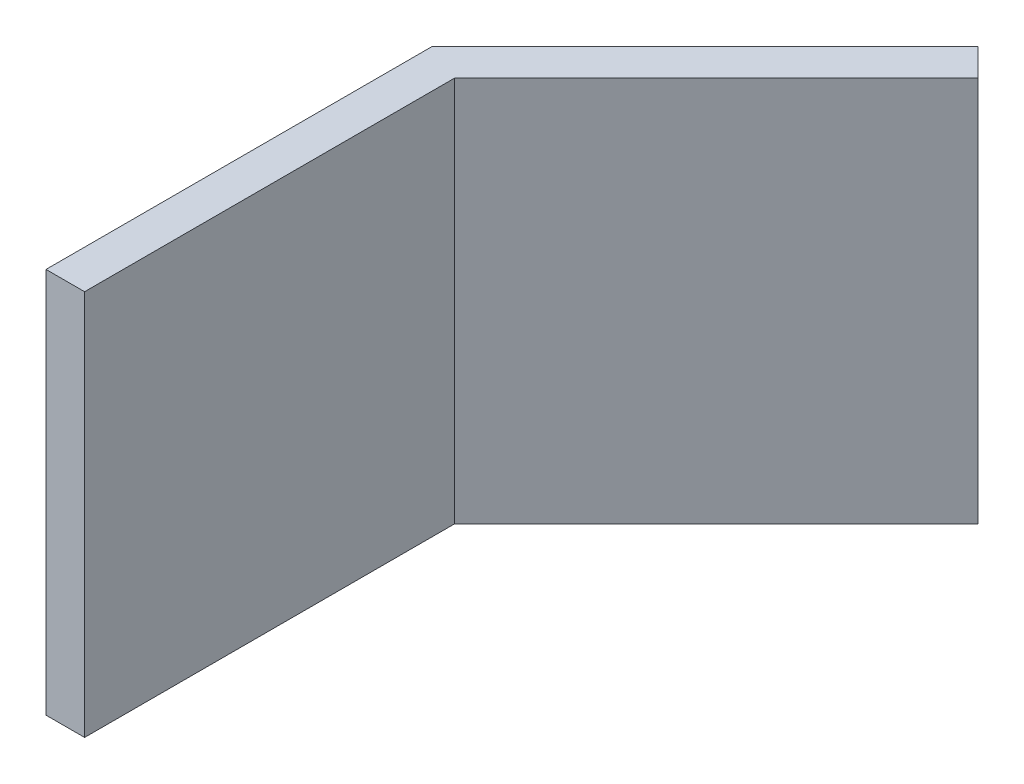
ISO-10303-21;
HEADER;
FILE_DESCRIPTION(('STEP AP214'),'2;1');
FILE_NAME('part.step','',(''),(''),'','','');
FILE_SCHEMA(('AUTOMOTIVE_DESIGN { 1 0 10303 214 1 1 1 1 }'));
ENDSEC;
DATA;
#1=APPLICATION_CONTEXT('core data for automotive mechanical design processes');
#2=APPLICATION_PROTOCOL_DEFINITION('international standard','automotive_design',2000,#1);
#3=PRODUCT_CONTEXT('',#1,'mechanical');
#4=PRODUCT('Part','Part','',(#3));
#5=PRODUCT_RELATED_PRODUCT_CATEGORY('part','',(#4));
#6=PRODUCT_DEFINITION_FORMATION('','',#4);
#7=PRODUCT_DEFINITION_CONTEXT('part definition',#1,'design');
#8=PRODUCT_DEFINITION('design','',#6,#7);
#9=PRODUCT_DEFINITION_SHAPE('','',#8);
#10=(LENGTH_UNIT() NAMED_UNIT(*) SI_UNIT(.MILLI.,.METRE.));
#11=(NAMED_UNIT(*) PLANE_ANGLE_UNIT() SI_UNIT($,.RADIAN.));
#12=(NAMED_UNIT(*) SI_UNIT($,.STERADIAN.) SOLID_ANGLE_UNIT());
#13=UNCERTAINTY_MEASURE_WITH_UNIT(LENGTH_MEASURE(1.E-05),#10,'distance_accuracy_value','');
#14=(GEOMETRIC_REPRESENTATION_CONTEXT(3) GLOBAL_UNCERTAINTY_ASSIGNED_CONTEXT((#13)) GLOBAL_UNIT_ASSIGNED_CONTEXT((#10,
#11,#12)) REPRESENTATION_CONTEXT('',''));
#15=CARTESIAN_POINT('',(0.,0.,0.));
#16=DIRECTION('',(0.,0.,1.));
#17=DIRECTION('',(1.,0.,0.));
#18=AXIS2_PLACEMENT_3D('',#15,#16,#17);
#19=CARTESIAN_POINT('',(2.,20.,0.));
#20=DIRECTION('',(0.,0.,-1.));
#21=DIRECTION('',(-1.,0.,0.));
#22=AXIS2_PLACEMENT_3D('',#19,#20,#21);
#23=PLANE('',#22);
#24=DIRECTION('',(1.,0.,0.));
#25=VECTOR('',#24,1.);
#26=CARTESIAN_POINT('',(2.,0.,0.));
#27=LINE('',#26,#25);
#28=CARTESIAN_POINT('',(0.,0.,0.));
#29=VERTEX_POINT('',#28);
#30=CARTESIAN_POINT('',(2.,0.,0.));
#31=VERTEX_POINT('',#30);
#32=EDGE_CURVE('E115',#29,#31,#27,.T.);
#33=ORIENTED_EDGE('',*,*,#32,.T.);
#34=DIRECTION('',(0.,-1.,0.));
#35=VECTOR('',#34,1.);
#36=CARTESIAN_POINT('',(2.,20.,0.));
#37=LINE('',#36,#35);
#38=CARTESIAN_POINT('',(2.,20.,0.));
#39=VERTEX_POINT('',#38);
#40=EDGE_CURVE('E11',#39,#31,#37,.T.);
#41=ORIENTED_EDGE('',*,*,#40,.F.);
#42=DIRECTION('',(1.,0.,0.));
#43=VECTOR('',#42,1.);
#44=CARTESIAN_POINT('',(2.,20.,0.));
#45=LINE('',#44,#43);
#46=CARTESIAN_POINT('',(0.,20.,0.));
#47=VERTEX_POINT('',#46);
#48=EDGE_CURVE('E125',#47,#39,#45,.T.);
#49=ORIENTED_EDGE('',*,*,#48,.F.);
#50=DIRECTION('',(0.,-1.,0.));
#51=VECTOR('',#50,1.);
#52=CARTESIAN_POINT('',(0.,20.,0.));
#53=LINE('',#52,#51);
#54=EDGE_CURVE('E111',#47,#29,#53,.T.);
#55=ORIENTED_EDGE('',*,*,#54,.T.);
#56=EDGE_LOOP('',(#33,#41,#49,#55));
#57=FACE_BOUND('',#56,.T.);
#58=ADVANCED_FACE('F31',(#57),#23,.F.);
#59=CARTESIAN_POINT('',(2.,20.,-19.1715728752538));
#60=DIRECTION('',(-1.,0.,0.));
#61=DIRECTION('',(0.,0.,1.));
#62=AXIS2_PLACEMENT_3D('',#59,#60,#61);
#63=PLANE('',#62);
#64=DIRECTION('',(0.,0.,-1.));
#65=VECTOR('',#64,1.);
#66=CARTESIAN_POINT('',(2.,0.,-19.1715728752538));
#67=LINE('',#66,#65);
#68=CARTESIAN_POINT('',(2.,0.,-19.1715728752538));
#69=VERTEX_POINT('',#68);
#70=EDGE_CURVE('E118',#31,#69,#67,.T.);
#71=ORIENTED_EDGE('',*,*,#70,.T.);
#72=DIRECTION('',(0.,-1.,0.));
#73=VECTOR('',#72,1.);
#74=CARTESIAN_POINT('',(2.,20.,-19.1715728752538));
#75=LINE('',#74,#73);
#76=CARTESIAN_POINT('',(2.,20.,-19.1715728752538));
#77=VERTEX_POINT('',#76);
#78=EDGE_CURVE('E39',#77,#69,#75,.T.);
#79=ORIENTED_EDGE('',*,*,#78,.F.);
#80=DIRECTION('',(0.,0.,-1.));
#81=VECTOR('',#80,1.);
#82=CARTESIAN_POINT('',(2.,20.,-19.1715728752538));
#83=LINE('',#82,#81);
#84=EDGE_CURVE('E84',#39,#77,#83,.T.);
#85=ORIENTED_EDGE('',*,*,#84,.F.);
#86=ORIENTED_EDGE('',*,*,#40,.T.);
#87=EDGE_LOOP('',(#71,#79,#85,#86));
#88=FACE_BOUND('',#87,.T.);
#89=ADVANCED_FACE('F149',(#88),#63,.F.);
#90=CARTESIAN_POINT('',(15.5563491861041,20.,-32.7279220613578));
#91=DIRECTION('',(-0.707106781186546,0.,-0.707106781186549));
#92=DIRECTION('',(-0.707106781186549,0.,0.707106781186546));
#93=AXIS2_PLACEMENT_3D('',#90,#91,#92);
#94=PLANE('',#93);
#95=DIRECTION('',(0.707106781186549,0.,-0.707106781186546));
#96=VECTOR('',#95,1.);
#97=CARTESIAN_POINT('',(15.5563491861041,0.,-32.7279220613578));
#98=LINE('',#97,#96);
#99=CARTESIAN_POINT('',(15.5563491861041,0.,-32.7279220613578));
#100=VERTEX_POINT('',#99);
#101=EDGE_CURVE('E120',#69,#100,#98,.T.);
#102=ORIENTED_EDGE('',*,*,#101,.T.);
#103=DIRECTION('',(0.,-1.,0.));
#104=VECTOR('',#103,1.);
#105=CARTESIAN_POINT('',(15.5563491861041,20.,-32.7279220613578));
#106=LINE('',#105,#104);
#107=CARTESIAN_POINT('',(15.5563491861041,20.,-32.7279220613578));
#108=VERTEX_POINT('',#107);
#109=EDGE_CURVE('E106',#108,#100,#106,.T.);
#110=ORIENTED_EDGE('',*,*,#109,.F.);
#111=DIRECTION('',(0.707106781186549,0.,-0.707106781186546));
#112=VECTOR('',#111,1.);
#113=CARTESIAN_POINT('',(15.5563491861041,20.,-32.7279220613578));
#114=LINE('',#113,#112);
#115=EDGE_CURVE('E97',#77,#108,#114,.T.);
#116=ORIENTED_EDGE('',*,*,#115,.F.);
#117=ORIENTED_EDGE('',*,*,#78,.T.);
#118=EDGE_LOOP('',(#102,#110,#116,#117));
#119=FACE_BOUND('',#118,.T.);
#120=ADVANCED_FACE('F131',(#119),#94,.F.);
#121=CARTESIAN_POINT('',(14.142135623731,20.,-34.1421356237309));
#122=DIRECTION('',(-0.707106781186549,0.,0.707106781186546));
#123=DIRECTION('',(0.707106781186546,0.,0.707106781186549));
#124=AXIS2_PLACEMENT_3D('',#121,#122,#123);
#125=PLANE('',#124);
#126=DIRECTION('',(-0.707106781186546,0.,-0.707106781186549));
#127=VECTOR('',#126,1.);
#128=CARTESIAN_POINT('',(14.142135623731,0.,-34.1421356237309));
#129=LINE('',#128,#127);
#130=CARTESIAN_POINT('',(14.142135623731,0.,-34.1421356237309));
#131=VERTEX_POINT('',#130);
#132=EDGE_CURVE('E105',#100,#131,#129,.T.);
#133=ORIENTED_EDGE('',*,*,#132,.T.);
#134=DIRECTION('',(0.,-1.,0.));
#135=VECTOR('',#134,1.);
#136=CARTESIAN_POINT('',(14.142135623731,20.,-34.1421356237309));
#137=LINE('',#136,#135);
#138=CARTESIAN_POINT('',(14.142135623731,20.,-34.1421356237309));
#139=VERTEX_POINT('',#138);
#140=EDGE_CURVE('E102',#139,#131,#137,.T.);
#141=ORIENTED_EDGE('',*,*,#140,.F.);
#142=DIRECTION('',(-0.707106781186546,0.,-0.707106781186549));
#143=VECTOR('',#142,1.);
#144=CARTESIAN_POINT('',(14.142135623731,20.,-34.1421356237309));
#145=LINE('',#144,#143);
#146=EDGE_CURVE('E91',#108,#139,#145,.T.);
#147=ORIENTED_EDGE('',*,*,#146,.F.);
#148=ORIENTED_EDGE('',*,*,#109,.T.);
#149=EDGE_LOOP('',(#133,#141,#147,#148));
#150=FACE_BOUND('',#149,.T.);
#151=ADVANCED_FACE('F103',(#150),#125,.F.);
#152=CARTESIAN_POINT('',(0.,20.,-20.));
#153=DIRECTION('',(0.707106781186546,0.,0.707106781186549));
#154=DIRECTION('',(0.707106781186549,0.,-0.707106781186546));
#155=AXIS2_PLACEMENT_3D('',#152,#153,#154);
#156=PLANE('',#155);
#157=DIRECTION('',(-0.707106781186549,0.,0.707106781186546));
#158=VECTOR('',#157,1.);
#159=CARTESIAN_POINT('',(0.,0.,-20.));
#160=LINE('',#159,#158);
#161=CARTESIAN_POINT('',(0.,0.,-20.));
#162=VERTEX_POINT('',#161);
#163=EDGE_CURVE('E70',#131,#162,#160,.T.);
#164=ORIENTED_EDGE('',*,*,#163,.T.);
#165=DIRECTION('',(0.,-1.,0.));
#166=VECTOR('',#165,1.);
#167=CARTESIAN_POINT('',(0.,20.,-20.));
#168=LINE('',#167,#166);
#169=CARTESIAN_POINT('',(0.,20.,-20.));
#170=VERTEX_POINT('',#169);
#171=EDGE_CURVE('E107',#170,#162,#168,.T.);
#172=ORIENTED_EDGE('',*,*,#171,.F.);
#173=DIRECTION('',(-0.707106781186549,0.,0.707106781186546));
#174=VECTOR('',#173,1.);
#175=CARTESIAN_POINT('',(0.,20.,-20.));
#176=LINE('',#175,#174);
#177=EDGE_CURVE('E95',#139,#170,#176,.T.);
#178=ORIENTED_EDGE('',*,*,#177,.F.);
#179=ORIENTED_EDGE('',*,*,#140,.T.);
#180=EDGE_LOOP('',(#164,#172,#178,#179));
#181=FACE_BOUND('',#180,.T.);
#182=ADVANCED_FACE('F109',(#181),#156,.F.);
#183=CARTESIAN_POINT('',(0.,20.,0.));
#184=DIRECTION('',(1.,0.,0.));
#185=DIRECTION('',(0.,0.,-1.));
#186=AXIS2_PLACEMENT_3D('',#183,#184,#185);
#187=PLANE('',#186);
#188=DIRECTION('',(0.,0.,1.));
#189=VECTOR('',#188,1.);
#190=CARTESIAN_POINT('',(0.,0.,0.));
#191=LINE('',#190,#189);
#192=EDGE_CURVE('E76',#162,#29,#191,.T.);
#193=ORIENTED_EDGE('',*,*,#192,.T.);
#194=ORIENTED_EDGE('',*,*,#54,.F.);
#195=DIRECTION('',(0.,0.,1.));
#196=VECTOR('',#195,1.);
#197=CARTESIAN_POINT('',(0.,20.,0.));
#198=LINE('',#197,#196);
#199=EDGE_CURVE('E47',#170,#47,#198,.T.);
#200=ORIENTED_EDGE('',*,*,#199,.F.);
#201=ORIENTED_EDGE('',*,*,#171,.T.);
#202=EDGE_LOOP('',(#193,#194,#200,#201));
#203=FACE_BOUND('',#202,.T.);
#204=ADVANCED_FACE('F138',(#203),#187,.F.);
#205=CARTESIAN_POINT('',(0.,20.,0.));
#206=DIRECTION('',(0.,-1.,0.));
#207=DIRECTION('',(0.,0.,-1.));
#208=AXIS2_PLACEMENT_3D('',#205,#206,#207);
#209=PLANE('',#208);
#210=ORIENTED_EDGE('',*,*,#48,.T.);
#211=ORIENTED_EDGE('',*,*,#84,.T.);
#212=ORIENTED_EDGE('',*,*,#115,.T.);
#213=ORIENTED_EDGE('',*,*,#146,.T.);
#214=ORIENTED_EDGE('',*,*,#177,.T.);
#215=ORIENTED_EDGE('',*,*,#199,.T.);
#216=EDGE_LOOP('',(#210,#211,#212,#213,#214,#215));
#217=FACE_BOUND('',#216,.T.);
#218=ADVANCED_FACE('F93',(#217),#209,.F.);
#219=CARTESIAN_POINT('',(0.,0.,0.));
#220=DIRECTION('',(0.,-1.,0.));
#221=DIRECTION('',(0.,0.,-1.));
#222=AXIS2_PLACEMENT_3D('',#219,#220,#221);
#223=PLANE('',#222);
#224=ORIENTED_EDGE('',*,*,#32,.F.);
#225=ORIENTED_EDGE('',*,*,#192,.F.);
#226=ORIENTED_EDGE('',*,*,#163,.F.);
#227=ORIENTED_EDGE('',*,*,#132,.F.);
#228=ORIENTED_EDGE('',*,*,#101,.F.);
#229=ORIENTED_EDGE('',*,*,#70,.F.);
#230=EDGE_LOOP('',(#224,#225,#226,#227,#228,#229));
#231=FACE_BOUND('',#230,.T.);
#232=ADVANCED_FACE('F134',(#231),#223,.T.);
#233=CLOSED_SHELL('',(#58,#89,#120,#151,#182,#204,#218,#232));
#234=MANIFOLD_SOLID_BREP('B2',#233);
#235=ADVANCED_BREP_SHAPE_REPRESENTATION('',(#18,#234),#14);
#236=SHAPE_DEFINITION_REPRESENTATION(#9,#235);
ENDSEC;
END-ISO-10303-21;
